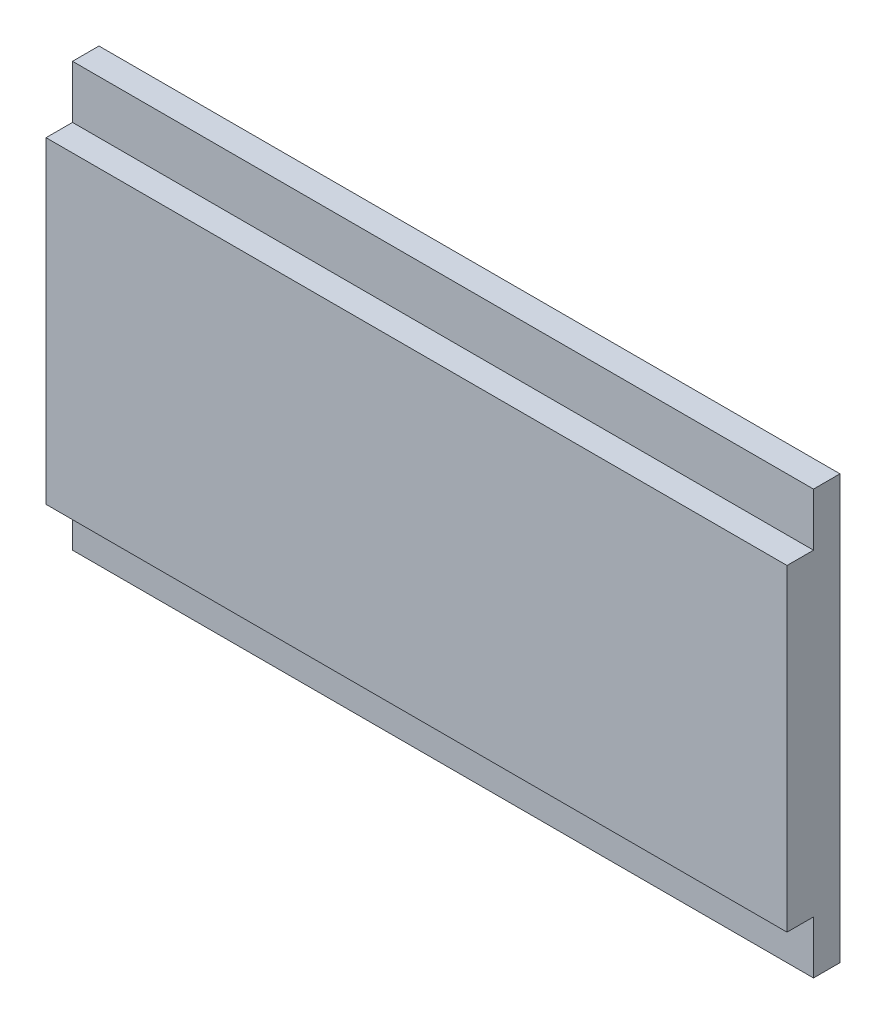
ISO-10303-21;
HEADER;
FILE_DESCRIPTION(('STEP AP214'),'2;1');
FILE_NAME('part.step','',(''),(''),'','','');
FILE_SCHEMA(('AUTOMOTIVE_DESIGN { 1 0 10303 214 1 1 1 1 }'));
ENDSEC;
DATA;
#1=APPLICATION_CONTEXT('core data for automotive mechanical design processes');
#2=APPLICATION_PROTOCOL_DEFINITION('international standard','automotive_design',2000,#1);
#3=PRODUCT_CONTEXT('',#1,'mechanical');
#4=PRODUCT('Part','Part','',(#3));
#5=PRODUCT_RELATED_PRODUCT_CATEGORY('part','',(#4));
#6=PRODUCT_DEFINITION_FORMATION('','',#4);
#7=PRODUCT_DEFINITION_CONTEXT('part definition',#1,'design');
#8=PRODUCT_DEFINITION('design','',#6,#7);
#9=PRODUCT_DEFINITION_SHAPE('','',#8);
#10=(LENGTH_UNIT() NAMED_UNIT(*) SI_UNIT(.MILLI.,.METRE.));
#11=(NAMED_UNIT(*) PLANE_ANGLE_UNIT() SI_UNIT($,.RADIAN.));
#12=(NAMED_UNIT(*) SI_UNIT($,.STERADIAN.) SOLID_ANGLE_UNIT());
#13=UNCERTAINTY_MEASURE_WITH_UNIT(LENGTH_MEASURE(1.E-05),#10,'distance_accuracy_value','');
#14=(GEOMETRIC_REPRESENTATION_CONTEXT(3) GLOBAL_UNCERTAINTY_ASSIGNED_CONTEXT((#13)) GLOBAL_UNIT_ASSIGNED_CONTEXT((#10,
#11,#12)) REPRESENTATION_CONTEXT('',''));
#15=CARTESIAN_POINT('',(0.,0.,0.));
#16=DIRECTION('',(0.,0.,1.));
#17=DIRECTION('',(1.,0.,0.));
#18=AXIS2_PLACEMENT_3D('',#15,#16,#17);
#19=CARTESIAN_POINT('',(44.45,-19.05,6.35));
#20=DIRECTION('',(-1.,0.,0.));
#21=DIRECTION('',(0.,0.,1.));
#22=AXIS2_PLACEMENT_3D('',#19,#20,#21);
#23=PLANE('',#22);
#24=DIRECTION('',(0.,1.,0.));
#25=VECTOR('',#24,1.);
#26=CARTESIAN_POINT('',(44.45,-19.05,0.));
#27=LINE('',#26,#25);
#28=CARTESIAN_POINT('',(44.45,-25.4,0.));
#29=VERTEX_POINT('',#28);
#30=CARTESIAN_POINT('',(44.45,25.4,0.));
#31=VERTEX_POINT('',#30);
#32=EDGE_CURVE('E113',#29,#31,#27,.T.);
#33=ORIENTED_EDGE('',*,*,#32,.T.);
#34=DIRECTION('',(0.,0.,-1.));
#35=VECTOR('',#34,1.);
#36=CARTESIAN_POINT('',(44.45,25.4,3.175));
#37=LINE('',#36,#35);
#38=CARTESIAN_POINT('',(44.45,25.4,3.175));
#39=VERTEX_POINT('',#38);
#40=EDGE_CURVE('E145',#39,#31,#37,.T.);
#41=ORIENTED_EDGE('',*,*,#40,.F.);
#42=DIRECTION('',(0.,-1.,0.));
#43=VECTOR('',#42,1.);
#44=CARTESIAN_POINT('',(44.45,19.05,3.175));
#45=LINE('',#44,#43);
#46=CARTESIAN_POINT('',(44.45,19.05,3.175));
#47=VERTEX_POINT('',#46);
#48=EDGE_CURVE('E127',#39,#47,#45,.T.);
#49=ORIENTED_EDGE('',*,*,#48,.T.);
#50=DIRECTION('',(0.,0.,-1.));
#51=VECTOR('',#50,1.);
#52=CARTESIAN_POINT('',(44.45,19.05,6.35));
#53=LINE('',#52,#51);
#54=CARTESIAN_POINT('',(44.45,19.05,6.35));
#55=VERTEX_POINT('',#54);
#56=EDGE_CURVE('E11',#55,#47,#53,.T.);
#57=ORIENTED_EDGE('',*,*,#56,.F.);
#58=DIRECTION('',(0.,1.,0.));
#59=VECTOR('',#58,1.);
#60=CARTESIAN_POINT('',(44.45,-19.05,6.35));
#61=LINE('',#60,#59);
#62=CARTESIAN_POINT('',(44.45,-19.05,6.35));
#63=VERTEX_POINT('',#62);
#64=EDGE_CURVE('E112',#63,#55,#61,.T.);
#65=ORIENTED_EDGE('',*,*,#64,.F.);
#66=DIRECTION('',(0.,0.,-1.));
#67=VECTOR('',#66,1.);
#68=CARTESIAN_POINT('',(44.45,-19.05,6.35));
#69=LINE('',#68,#67);
#70=CARTESIAN_POINT('',(44.45,-19.05,3.175));
#71=VERTEX_POINT('',#70);
#72=EDGE_CURVE('E157',#63,#71,#69,.T.);
#73=ORIENTED_EDGE('',*,*,#72,.T.);
#74=DIRECTION('',(0.,-1.,0.));
#75=VECTOR('',#74,1.);
#76=CARTESIAN_POINT('',(44.45,-19.05,3.175));
#77=LINE('',#76,#75);
#78=CARTESIAN_POINT('',(44.45,-25.4,3.175));
#79=VERTEX_POINT('',#78);
#80=EDGE_CURVE('E50',#71,#79,#77,.T.);
#81=ORIENTED_EDGE('',*,*,#80,.T.);
#82=DIRECTION('',(0.,0.,-1.));
#83=VECTOR('',#82,1.);
#84=CARTESIAN_POINT('',(44.45,-25.4,3.175));
#85=LINE('',#84,#83);
#86=EDGE_CURVE('E121',#79,#29,#85,.T.);
#87=ORIENTED_EDGE('',*,*,#86,.T.);
#88=EDGE_LOOP('',(#33,#41,#49,#57,#65,#73,#81,#87));
#89=FACE_BOUND('',#88,.T.);
#90=ADVANCED_FACE('F36',(#89),#23,.F.);
#91=CARTESIAN_POINT('',(-44.45,19.05,6.35));
#92=DIRECTION('',(0.,-1.,0.));
#93=DIRECTION('',(0.,0.,-1.));
#94=AXIS2_PLACEMENT_3D('',#91,#92,#93);
#95=PLANE('',#94);
#96=ORIENTED_EDGE('',*,*,#56,.T.);
#97=DIRECTION('',(-1.,0.,0.));
#98=VECTOR('',#97,1.);
#99=CARTESIAN_POINT('',(44.45,19.05,3.175));
#100=LINE('',#99,#98);
#101=CARTESIAN_POINT('',(-44.45,19.05,3.175));
#102=VERTEX_POINT('',#101);
#103=EDGE_CURVE('E139',#47,#102,#100,.T.);
#104=ORIENTED_EDGE('',*,*,#103,.T.);
#105=DIRECTION('',(0.,0.,-1.));
#106=VECTOR('',#105,1.);
#107=CARTESIAN_POINT('',(-44.45,19.05,6.35));
#108=LINE('',#107,#106);
#109=CARTESIAN_POINT('',(-44.45,19.05,6.35));
#110=VERTEX_POINT('',#109);
#111=EDGE_CURVE('E43',#110,#102,#108,.T.);
#112=ORIENTED_EDGE('',*,*,#111,.F.);
#113=DIRECTION('',(-1.,0.,0.));
#114=VECTOR('',#113,1.);
#115=CARTESIAN_POINT('',(-44.45,19.05,6.35));
#116=LINE('',#115,#114);
#117=EDGE_CURVE('E151',#55,#110,#116,.T.);
#118=ORIENTED_EDGE('',*,*,#117,.F.);
#119=EDGE_LOOP('',(#96,#104,#112,#118));
#120=FACE_BOUND('',#119,.T.);
#121=ADVANCED_FACE('F168',(#120),#95,.F.);
#122=CARTESIAN_POINT('',(-44.45,-19.05,6.35));
#123=DIRECTION('',(1.,0.,0.));
#124=DIRECTION('',(0.,0.,-1.));
#125=AXIS2_PLACEMENT_3D('',#122,#123,#124);
#126=PLANE('',#125);
#127=DIRECTION('',(0.,-1.,0.));
#128=VECTOR('',#127,1.);
#129=CARTESIAN_POINT('',(-44.45,-19.05,0.));
#130=LINE('',#129,#128);
#131=CARTESIAN_POINT('',(-44.45,25.4,0.));
#132=VERTEX_POINT('',#131);
#133=CARTESIAN_POINT('',(-44.45,-25.4,0.));
#134=VERTEX_POINT('',#133);
#135=EDGE_CURVE('E102',#132,#134,#130,.T.);
#136=ORIENTED_EDGE('',*,*,#135,.T.);
#137=DIRECTION('',(0.,0.,-1.));
#138=VECTOR('',#137,1.);
#139=CARTESIAN_POINT('',(-44.45,-25.4,3.175));
#140=LINE('',#139,#138);
#141=CARTESIAN_POINT('',(-44.45,-25.4,3.175));
#142=VERTEX_POINT('',#141);
#143=EDGE_CURVE('E105',#142,#134,#140,.T.);
#144=ORIENTED_EDGE('',*,*,#143,.F.);
#145=DIRECTION('',(0.,1.,0.));
#146=VECTOR('',#145,1.);
#147=CARTESIAN_POINT('',(-44.45,-19.05,3.175));
#148=LINE('',#147,#146);
#149=CARTESIAN_POINT('',(-44.45,-19.05,3.175));
#150=VERTEX_POINT('',#149);
#151=EDGE_CURVE('E134',#142,#150,#148,.T.);
#152=ORIENTED_EDGE('',*,*,#151,.T.);
#153=DIRECTION('',(0.,0.,-1.));
#154=VECTOR('',#153,1.);
#155=CARTESIAN_POINT('',(-44.45,-19.05,6.35));
#156=LINE('',#155,#154);
#157=CARTESIAN_POINT('',(-44.45,-19.05,6.35));
#158=VERTEX_POINT('',#157);
#159=EDGE_CURVE('E161',#158,#150,#156,.T.);
#160=ORIENTED_EDGE('',*,*,#159,.F.);
#161=DIRECTION('',(0.,-1.,0.));
#162=VECTOR('',#161,1.);
#163=CARTESIAN_POINT('',(-44.45,-19.05,6.35));
#164=LINE('',#163,#162);
#165=EDGE_CURVE('E153',#110,#158,#164,.T.);
#166=ORIENTED_EDGE('',*,*,#165,.F.);
#167=ORIENTED_EDGE('',*,*,#111,.T.);
#168=DIRECTION('',(0.,1.,0.));
#169=VECTOR('',#168,1.);
#170=CARTESIAN_POINT('',(-44.45,19.05,3.175));
#171=LINE('',#170,#169);
#172=CARTESIAN_POINT('',(-44.45,25.4,3.175));
#173=VERTEX_POINT('',#172);
#174=EDGE_CURVE('E58',#102,#173,#171,.T.);
#175=ORIENTED_EDGE('',*,*,#174,.T.);
#176=DIRECTION('',(0.,0.,-1.));
#177=VECTOR('',#176,1.);
#178=CARTESIAN_POINT('',(-44.45,25.4,3.175));
#179=LINE('',#178,#177);
#180=EDGE_CURVE('E107',#173,#132,#179,.T.);
#181=ORIENTED_EDGE('',*,*,#180,.T.);
#182=EDGE_LOOP('',(#136,#144,#152,#160,#166,#167,#175,#181));
#183=FACE_BOUND('',#182,.T.);
#184=ADVANCED_FACE('F104',(#183),#126,.F.);
#185=CARTESIAN_POINT('',(-44.45,-19.05,6.35));
#186=DIRECTION('',(0.,1.,0.));
#187=DIRECTION('',(0.,0.,1.));
#188=AXIS2_PLACEMENT_3D('',#185,#186,#187);
#189=PLANE('',#188);
#190=ORIENTED_EDGE('',*,*,#159,.T.);
#191=DIRECTION('',(1.,0.,0.));
#192=VECTOR('',#191,1.);
#193=CARTESIAN_POINT('',(44.45,-19.05,3.175));
#194=LINE('',#193,#192);
#195=EDGE_CURVE('E132',#150,#71,#194,.T.);
#196=ORIENTED_EDGE('',*,*,#195,.T.);
#197=ORIENTED_EDGE('',*,*,#72,.F.);
#198=DIRECTION('',(1.,0.,0.));
#199=VECTOR('',#198,1.);
#200=CARTESIAN_POINT('',(-44.45,-19.05,6.35));
#201=LINE('',#200,#199);
#202=EDGE_CURVE('E155',#158,#63,#201,.T.);
#203=ORIENTED_EDGE('',*,*,#202,.F.);
#204=EDGE_LOOP('',(#190,#196,#197,#203));
#205=FACE_BOUND('',#204,.T.);
#206=ADVANCED_FACE('F193',(#205),#189,.F.);
#207=CARTESIAN_POINT('',(0.,0.,6.35));
#208=DIRECTION('',(0.,0.,-1.));
#209=DIRECTION('',(-1.,0.,0.));
#210=AXIS2_PLACEMENT_3D('',#207,#208,#209);
#211=PLANE('',#210);
#212=ORIENTED_EDGE('',*,*,#64,.T.);
#213=ORIENTED_EDGE('',*,*,#117,.T.);
#214=ORIENTED_EDGE('',*,*,#165,.T.);
#215=ORIENTED_EDGE('',*,*,#202,.T.);
#216=EDGE_LOOP('',(#212,#213,#214,#215));
#217=FACE_BOUND('',#216,.T.);
#218=ADVANCED_FACE('F183',(#217),#211,.F.);
#219=CARTESIAN_POINT('',(0.,0.,0.));
#220=DIRECTION('',(0.,0.,-1.));
#221=DIRECTION('',(-1.,0.,0.));
#222=AXIS2_PLACEMENT_3D('',#219,#220,#221);
#223=PLANE('',#222);
#224=ORIENTED_EDGE('',*,*,#32,.F.);
#225=DIRECTION('',(-1.,0.,0.));
#226=VECTOR('',#225,1.);
#227=CARTESIAN_POINT('',(44.45,-25.4,0.));
#228=LINE('',#227,#226);
#229=EDGE_CURVE('E119',#29,#134,#228,.T.);
#230=ORIENTED_EDGE('',*,*,#229,.T.);
#231=ORIENTED_EDGE('',*,*,#135,.F.);
#232=DIRECTION('',(1.,0.,0.));
#233=VECTOR('',#232,1.);
#234=CARTESIAN_POINT('',(44.45,25.4,0.));
#235=LINE('',#234,#233);
#236=EDGE_CURVE('E125',#132,#31,#235,.T.);
#237=ORIENTED_EDGE('',*,*,#236,.T.);
#238=EDGE_LOOP('',(#224,#230,#231,#237));
#239=FACE_BOUND('',#238,.T.);
#240=ADVANCED_FACE('F123',(#239),#223,.T.);
#241=CARTESIAN_POINT('',(44.45,25.4,3.175));
#242=DIRECTION('',(0.,1.,0.));
#243=DIRECTION('',(0.,0.,1.));
#244=AXIS2_PLACEMENT_3D('',#241,#242,#243);
#245=PLANE('',#244);
#246=ORIENTED_EDGE('',*,*,#236,.F.);
#247=ORIENTED_EDGE('',*,*,#180,.F.);
#248=DIRECTION('',(1.,0.,0.));
#249=VECTOR('',#248,1.);
#250=CARTESIAN_POINT('',(44.45,25.4,3.175));
#251=LINE('',#250,#249);
#252=EDGE_CURVE('E142',#173,#39,#251,.T.);
#253=ORIENTED_EDGE('',*,*,#252,.T.);
#254=ORIENTED_EDGE('',*,*,#40,.T.);
#255=EDGE_LOOP('',(#246,#247,#253,#254));
#256=FACE_BOUND('',#255,.T.);
#257=ADVANCED_FACE('F175',(#256),#245,.T.);
#258=CARTESIAN_POINT('',(0.,0.,3.175));
#259=DIRECTION('',(0.,0.,1.));
#260=DIRECTION('',(1.,0.,0.));
#261=AXIS2_PLACEMENT_3D('',#258,#259,#260);
#262=PLANE('',#261);
#263=ORIENTED_EDGE('',*,*,#48,.F.);
#264=ORIENTED_EDGE('',*,*,#252,.F.);
#265=ORIENTED_EDGE('',*,*,#174,.F.);
#266=ORIENTED_EDGE('',*,*,#103,.F.);
#267=EDGE_LOOP('',(#263,#264,#265,#266));
#268=FACE_BOUND('',#267,.T.);
#269=ADVANCED_FACE('F171',(#268),#262,.T.);
#270=CARTESIAN_POINT('',(44.45,-25.4,3.175));
#271=DIRECTION('',(0.,-1.,0.));
#272=DIRECTION('',(0.,0.,-1.));
#273=AXIS2_PLACEMENT_3D('',#270,#271,#272);
#274=PLANE('',#273);
#275=ORIENTED_EDGE('',*,*,#229,.F.);
#276=ORIENTED_EDGE('',*,*,#86,.F.);
#277=DIRECTION('',(-1.,0.,0.));
#278=VECTOR('',#277,1.);
#279=CARTESIAN_POINT('',(44.45,-25.4,3.175));
#280=LINE('',#279,#278);
#281=EDGE_CURVE('E120',#79,#142,#280,.T.);
#282=ORIENTED_EDGE('',*,*,#281,.T.);
#283=ORIENTED_EDGE('',*,*,#143,.T.);
#284=EDGE_LOOP('',(#275,#276,#282,#283));
#285=FACE_BOUND('',#284,.T.);
#286=ADVANCED_FACE('F118',(#285),#274,.T.);
#287=CARTESIAN_POINT('',(0.,0.,3.175));
#288=DIRECTION('',(0.,0.,-1.));
#289=DIRECTION('',(-1.,0.,0.));
#290=AXIS2_PLACEMENT_3D('',#287,#288,#289);
#291=PLANE('',#290);
#292=ORIENTED_EDGE('',*,*,#80,.F.);
#293=ORIENTED_EDGE('',*,*,#195,.F.);
#294=ORIENTED_EDGE('',*,*,#151,.F.);
#295=ORIENTED_EDGE('',*,*,#281,.F.);
#296=EDGE_LOOP('',(#292,#293,#294,#295));
#297=FACE_BOUND('',#296,.T.);
#298=ADVANCED_FACE('F204',(#297),#291,.F.);
#299=CLOSED_SHELL('',(#90,#121,#184,#206,#218,#240,#257,#269,#286,#298));
#300=MANIFOLD_SOLID_BREP('B2',#299);
#301=ADVANCED_BREP_SHAPE_REPRESENTATION('',(#18,#300),#14);
#302=SHAPE_DEFINITION_REPRESENTATION(#9,#301);
ENDSEC;
END-ISO-10303-21;
